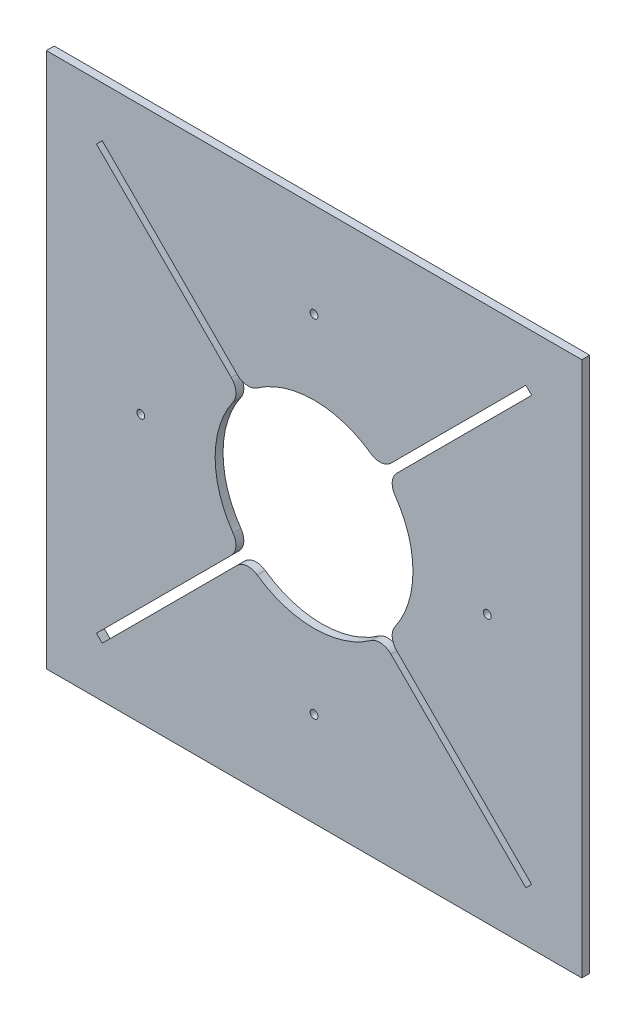
ISO-10303-21;
HEADER;
FILE_DESCRIPTION(('STEP AP214'),'2;1');
FILE_NAME('part.step','',(''),(''),'','','');
FILE_SCHEMA(('AUTOMOTIVE_DESIGN { 1 0 10303 214 1 1 1 1 }'));
ENDSEC;
DATA;
#1=APPLICATION_CONTEXT('core data for automotive mechanical design processes');
#2=APPLICATION_PROTOCOL_DEFINITION('international standard','automotive_design',2000,#1);
#3=PRODUCT_CONTEXT('',#1,'mechanical');
#4=PRODUCT('Part','Part','',(#3));
#5=PRODUCT_RELATED_PRODUCT_CATEGORY('part','',(#4));
#6=PRODUCT_DEFINITION_FORMATION('','',#4);
#7=PRODUCT_DEFINITION_CONTEXT('part definition',#1,'design');
#8=PRODUCT_DEFINITION('design','',#6,#7);
#9=PRODUCT_DEFINITION_SHAPE('','',#8);
#10=(LENGTH_UNIT() NAMED_UNIT(*) SI_UNIT(.MILLI.,.METRE.));
#11=(NAMED_UNIT(*) PLANE_ANGLE_UNIT() SI_UNIT($,.RADIAN.));
#12=(NAMED_UNIT(*) SI_UNIT($,.STERADIAN.) SOLID_ANGLE_UNIT());
#13=UNCERTAINTY_MEASURE_WITH_UNIT(LENGTH_MEASURE(1.E-05),#10,'distance_accuracy_value','');
#14=(GEOMETRIC_REPRESENTATION_CONTEXT(3) GLOBAL_UNCERTAINTY_ASSIGNED_CONTEXT((#13)) GLOBAL_UNIT_ASSIGNED_CONTEXT((#10,
#11,#12)) REPRESENTATION_CONTEXT('',''));
#15=CARTESIAN_POINT('',(0.,0.,0.));
#16=DIRECTION('',(0.,0.,1.));
#17=DIRECTION('',(1.,0.,0.));
#18=AXIS2_PLACEMENT_3D('',#15,#16,#17);
#19=CARTESIAN_POINT('',(0.,0.,0.));
#20=DIRECTION('',(0.,0.,1.));
#21=DIRECTION('',(1.,0.,0.));
#22=AXIS2_PLACEMENT_3D('',#19,#20,#21);
#23=CYLINDRICAL_SURFACE('',#22,79.756);
#24=CARTESIAN_POINT('',(0.,0.,6.35));
#25=DIRECTION('',(0.,0.,1.));
#26=DIRECTION('',(1.,0.,0.));
#27=AXIS2_PLACEMENT_3D('',#24,#25,#26);
#28=CIRCLE('',#27,79.756);
#29=CARTESIAN_POINT('',(-45.7840497373217,-65.3057449666602,6.35));
#30=VERTEX_POINT('',#29);
#31=CARTESIAN_POINT('',(45.7840497373238,-65.3057449666587,6.35));
#32=VERTEX_POINT('',#31);
#33=EDGE_CURVE('E360',#30,#32,#28,.T.);
#34=ORIENTED_EDGE('',*,*,#33,.T.);
#35=DIRECTION('',(0.,0.,1.));
#36=VECTOR('',#35,1.);
#37=CARTESIAN_POINT('',(45.7840497373238,-65.3057449666587,0.));
#38=LINE('',#37,#36);
#39=CARTESIAN_POINT('',(45.7840497373238,-65.3057449666587,0.));
#40=VERTEX_POINT('',#39);
#41=EDGE_CURVE('E469',#32,#40,#38,.F.);
#42=ORIENTED_EDGE('',*,*,#41,.T.);
#43=CARTESIAN_POINT('',(0.,0.,0.));
#44=DIRECTION('',(0.,0.,1.));
#45=DIRECTION('',(1.,0.,0.));
#46=AXIS2_PLACEMENT_3D('',#43,#44,#45);
#47=CIRCLE('',#46,79.756);
#48=CARTESIAN_POINT('',(-45.7840497373217,-65.3057449666602,0.));
#49=VERTEX_POINT('',#48);
#50=EDGE_CURVE('E358',#49,#40,#47,.T.);
#51=ORIENTED_EDGE('',*,*,#50,.F.);
#52=DIRECTION('',(0.,0.,1.));
#53=VECTOR('',#52,1.);
#54=CARTESIAN_POINT('',(-45.7840497373217,-65.3057449666602,0.));
#55=LINE('',#54,#53);
#56=EDGE_CURVE('E465',#49,#30,#55,.T.);
#57=ORIENTED_EDGE('',*,*,#56,.T.);
#58=EDGE_LOOP('',(#34,#42,#51,#57));
#59=FACE_BOUND('',#58,.T.);
#60=ADVANCED_FACE('F39',(#59),#23,.F.);
#61=CARTESIAN_POINT('',(65.3057449666625,-45.7840497373182,0.));
#62=VERTEX_POINT('',#61);
#63=CARTESIAN_POINT('',(65.305744966661,45.7840497373205,0.));
#64=VERTEX_POINT('',#63);
#65=EDGE_CURVE('E359',#62,#64,#47,.T.);
#66=ORIENTED_EDGE('',*,*,#65,.F.);
#67=DIRECTION('',(0.,0.,1.));
#68=VECTOR('',#67,1.);
#69=CARTESIAN_POINT('',(65.3057449666625,-45.7840497373182,0.));
#70=LINE('',#69,#68);
#71=CARTESIAN_POINT('',(65.3057449666625,-45.7840497373182,6.35));
#72=VERTEX_POINT('',#71);
#73=EDGE_CURVE('E412',#62,#72,#70,.T.);
#74=ORIENTED_EDGE('',*,*,#73,.T.);
#75=CARTESIAN_POINT('',(65.305744966661,45.7840497373205,6.35));
#76=VERTEX_POINT('',#75);
#77=EDGE_CURVE('E350',#72,#76,#28,.T.);
#78=ORIENTED_EDGE('',*,*,#77,.T.);
#79=DIRECTION('',(0.,0.,1.));
#80=VECTOR('',#79,1.);
#81=CARTESIAN_POINT('',(65.305744966661,45.7840497373205,0.));
#82=LINE('',#81,#80);
#83=EDGE_CURVE('E408',#76,#64,#82,.F.);
#84=ORIENTED_EDGE('',*,*,#83,.T.);
#85=EDGE_LOOP('',(#66,#74,#78,#84));
#86=FACE_BOUND('',#85,.T.);
#87=ADVANCED_FACE('F532',(#86),#23,.F.);
#88=CARTESIAN_POINT('',(45.7840497373215,65.3057449666603,0.));
#89=VERTEX_POINT('',#88);
#90=CARTESIAN_POINT('',(-45.7840497373208,65.3057449666608,0.));
#91=VERTEX_POINT('',#90);
#92=EDGE_CURVE('E357',#89,#91,#47,.T.);
#93=ORIENTED_EDGE('',*,*,#92,.F.);
#94=DIRECTION('',(0.,0.,1.));
#95=VECTOR('',#94,1.);
#96=CARTESIAN_POINT('',(45.7840497373215,65.3057449666603,0.));
#97=LINE('',#96,#95);
#98=CARTESIAN_POINT('',(45.7840497373215,65.3057449666603,6.35));
#99=VERTEX_POINT('',#98);
#100=EDGE_CURVE('E496',#89,#99,#97,.T.);
#101=ORIENTED_EDGE('',*,*,#100,.T.);
#102=CARTESIAN_POINT('',(-45.7840497373208,65.3057449666608,6.35));
#103=VERTEX_POINT('',#102);
#104=EDGE_CURVE('E365',#99,#103,#28,.T.);
#105=ORIENTED_EDGE('',*,*,#104,.T.);
#106=DIRECTION('',(0.,0.,1.));
#107=VECTOR('',#106,1.);
#108=CARTESIAN_POINT('',(-45.7840497373208,65.3057449666608,0.));
#109=LINE('',#108,#107);
#110=EDGE_CURVE('E492',#103,#91,#109,.F.);
#111=ORIENTED_EDGE('',*,*,#110,.T.);
#112=EDGE_LOOP('',(#93,#101,#105,#111));
#113=FACE_BOUND('',#112,.T.);
#114=ADVANCED_FACE('F549',(#113),#23,.F.);
#115=CARTESIAN_POINT('',(215.9,215.9,6.35));
#116=DIRECTION('',(-1.,0.,0.));
#117=DIRECTION('',(0.,-1.,0.));
#118=AXIS2_PLACEMENT_3D('',#115,#116,#117);
#119=PLANE('',#118);
#120=DIRECTION('',(0.,1.,0.));
#121=VECTOR('',#120,1.);
#122=CARTESIAN_POINT('',(215.9,215.9,0.));
#123=LINE('',#122,#121);
#124=CARTESIAN_POINT('',(215.9,-215.9,0.));
#125=VERTEX_POINT('',#124);
#126=CARTESIAN_POINT('',(215.9,215.9,0.));
#127=VERTEX_POINT('',#126);
#128=EDGE_CURVE('E381',#125,#127,#123,.T.);
#129=ORIENTED_EDGE('',*,*,#128,.T.);
#130=DIRECTION('',(0.,0.,-1.));
#131=VECTOR('',#130,1.);
#132=CARTESIAN_POINT('',(215.9,215.9,6.35));
#133=LINE('',#132,#131);
#134=CARTESIAN_POINT('',(215.9,215.9,6.35));
#135=VERTEX_POINT('',#134);
#136=EDGE_CURVE('E404',#135,#127,#133,.T.);
#137=ORIENTED_EDGE('',*,*,#136,.F.);
#138=DIRECTION('',(0.,1.,0.));
#139=VECTOR('',#138,1.);
#140=CARTESIAN_POINT('',(215.9,215.9,6.35));
#141=LINE('',#140,#139);
#142=CARTESIAN_POINT('',(215.9,-215.9,6.35));
#143=VERTEX_POINT('',#142);
#144=EDGE_CURVE('E366',#143,#135,#141,.T.);
#145=ORIENTED_EDGE('',*,*,#144,.F.);
#146=DIRECTION('',(0.,0.,-1.));
#147=VECTOR('',#146,1.);
#148=CARTESIAN_POINT('',(215.9,-215.9,6.35));
#149=LINE('',#148,#147);
#150=EDGE_CURVE('E380',#143,#125,#149,.T.);
#151=ORIENTED_EDGE('',*,*,#150,.T.);
#152=EDGE_LOOP('',(#129,#137,#145,#151));
#153=FACE_BOUND('',#152,.T.);
#154=ADVANCED_FACE('F619',(#153),#119,.F.);
#155=CARTESIAN_POINT('',(-215.9,215.9,6.35));
#156=DIRECTION('',(0.,-1.,0.));
#157=DIRECTION('',(0.,0.,-1.));
#158=AXIS2_PLACEMENT_3D('',#155,#156,#157);
#159=PLANE('',#158);
#160=DIRECTION('',(-1.,0.,0.));
#161=VECTOR('',#160,1.);
#162=CARTESIAN_POINT('',(-215.9,215.9,0.));
#163=LINE('',#162,#161);
#164=CARTESIAN_POINT('',(-215.9,215.9,0.));
#165=VERTEX_POINT('',#164);
#166=EDGE_CURVE('E385',#127,#165,#163,.T.);
#167=ORIENTED_EDGE('',*,*,#166,.T.);
#168=DIRECTION('',(0.,0.,-1.));
#169=VECTOR('',#168,1.);
#170=CARTESIAN_POINT('',(-215.9,215.9,6.35));
#171=LINE('',#170,#169);
#172=CARTESIAN_POINT('',(-215.9,215.9,6.35));
#173=VERTEX_POINT('',#172);
#174=EDGE_CURVE('E400',#173,#165,#171,.T.);
#175=ORIENTED_EDGE('',*,*,#174,.F.);
#176=DIRECTION('',(-1.,0.,0.));
#177=VECTOR('',#176,1.);
#178=CARTESIAN_POINT('',(-215.9,215.9,6.35));
#179=LINE('',#178,#177);
#180=EDGE_CURVE('E370',#135,#173,#179,.T.);
#181=ORIENTED_EDGE('',*,*,#180,.F.);
#182=ORIENTED_EDGE('',*,*,#136,.T.);
#183=EDGE_LOOP('',(#167,#175,#181,#182));
#184=FACE_BOUND('',#183,.T.);
#185=ADVANCED_FACE('F623',(#184),#159,.F.);
#186=CARTESIAN_POINT('',(-215.9,215.9,6.35));
#187=DIRECTION('',(1.,0.,0.));
#188=DIRECTION('',(0.,1.,0.));
#189=AXIS2_PLACEMENT_3D('',#186,#187,#188);
#190=PLANE('',#189);
#191=DIRECTION('',(0.,-1.,0.));
#192=VECTOR('',#191,1.);
#193=CARTESIAN_POINT('',(-215.9,215.9,0.));
#194=LINE('',#193,#192);
#195=CARTESIAN_POINT('',(-215.9,-215.9,0.));
#196=VERTEX_POINT('',#195);
#197=EDGE_CURVE('E388',#165,#196,#194,.T.);
#198=ORIENTED_EDGE('',*,*,#197,.T.);
#199=DIRECTION('',(0.,0.,-1.));
#200=VECTOR('',#199,1.);
#201=CARTESIAN_POINT('',(-215.9,-215.9,6.35));
#202=LINE('',#201,#200);
#203=CARTESIAN_POINT('',(-215.9,-215.9,6.35));
#204=VERTEX_POINT('',#203);
#205=EDGE_CURVE('E396',#204,#196,#202,.T.);
#206=ORIENTED_EDGE('',*,*,#205,.F.);
#207=DIRECTION('',(0.,-1.,0.));
#208=VECTOR('',#207,1.);
#209=CARTESIAN_POINT('',(-215.9,215.9,6.35));
#210=LINE('',#209,#208);
#211=EDGE_CURVE('E374',#173,#204,#210,.T.);
#212=ORIENTED_EDGE('',*,*,#211,.F.);
#213=ORIENTED_EDGE('',*,*,#174,.T.);
#214=EDGE_LOOP('',(#198,#206,#212,#213));
#215=FACE_BOUND('',#214,.T.);
#216=ADVANCED_FACE('F629',(#215),#190,.F.);
#217=CARTESIAN_POINT('',(-215.9,-215.9,6.35));
#218=DIRECTION('',(0.,1.,0.));
#219=DIRECTION('',(0.,0.,1.));
#220=AXIS2_PLACEMENT_3D('',#217,#218,#219);
#221=PLANE('',#220);
#222=DIRECTION('',(1.,0.,0.));
#223=VECTOR('',#222,1.);
#224=CARTESIAN_POINT('',(-215.9,-215.9,0.));
#225=LINE('',#224,#223);
#226=EDGE_CURVE('E371',#196,#125,#225,.T.);
#227=ORIENTED_EDGE('',*,*,#226,.T.);
#228=ORIENTED_EDGE('',*,*,#150,.F.);
#229=DIRECTION('',(1.,0.,0.));
#230=VECTOR('',#229,1.);
#231=CARTESIAN_POINT('',(-215.9,-215.9,6.35));
#232=LINE('',#231,#230);
#233=EDGE_CURVE('E377',#204,#143,#232,.T.);
#234=ORIENTED_EDGE('',*,*,#233,.F.);
#235=ORIENTED_EDGE('',*,*,#205,.T.);
#236=EDGE_LOOP('',(#227,#228,#234,#235));
#237=FACE_BOUND('',#236,.T.);
#238=ADVANCED_FACE('F742',(#237),#221,.F.);
#239=CARTESIAN_POINT('',(0.,0.,6.35));
#240=DIRECTION('',(0.,0.,1.));
#241=DIRECTION('',(1.,0.,0.));
#242=AXIS2_PLACEMENT_3D('',#239,#240,#241);
#243=PLANE('',#242);
#244=CARTESIAN_POINT('',(0.,139.7,6.35));
#245=DIRECTION('',(0.,0.,1.));
#246=DIRECTION('',(1.,0.,0.));
#247=AXIS2_PLACEMENT_3D('',#244,#245,#246);
#248=CIRCLE('',#247,3.175);
#249=CARTESIAN_POINT('',(3.175,139.7,6.35));
#250=VERTEX_POINT('',#249);
#251=EDGE_CURVE('E777',#250,#250,#248,.T.);
#252=ORIENTED_EDGE('',*,*,#251,.F.);
#253=EDGE_LOOP('',(#252));
#254=FACE_BOUND('',#253,.T.);
#255=CARTESIAN_POINT('',(139.700000000004,3.9448503337513E-12,6.35));
#256=DIRECTION('',(0.,0.,1.));
#257=DIRECTION('',(1.,0.,0.));
#258=AXIS2_PLACEMENT_3D('',#255,#256,#257);
#259=CIRCLE('',#258,3.17500000000307);
#260=CARTESIAN_POINT('',(142.875000000007,3.9448503337513E-12,6.35));
#261=VERTEX_POINT('',#260);
#262=EDGE_CURVE('E781',#261,#261,#259,.T.);
#263=ORIENTED_EDGE('',*,*,#262,.F.);
#264=EDGE_LOOP('',(#263));
#265=FACE_BOUND('',#264,.T.);
#266=CARTESIAN_POINT('',(7.88970066750261E-12,-139.7,6.35));
#267=DIRECTION('',(0.,0.,1.));
#268=DIRECTION('',(1.,0.,0.));
#269=AXIS2_PLACEMENT_3D('',#266,#267,#268);
#270=CIRCLE('',#269,3.17500000000847);
#271=CARTESIAN_POINT('',(3.17500000001636,-139.7,6.35));
#272=VERTEX_POINT('',#271);
#273=EDGE_CURVE('E785',#272,#272,#270,.T.);
#274=ORIENTED_EDGE('',*,*,#273,.F.);
#275=EDGE_LOOP('',(#274));
#276=FACE_BOUND('',#275,.T.);
#277=CARTESIAN_POINT('',(-139.699999999996,-3.96195864953539E-12,6.35));
#278=DIRECTION('',(0.,0.,1.));
#279=DIRECTION('',(1.,0.,0.));
#280=AXIS2_PLACEMENT_3D('',#277,#278,#279);
#281=CIRCLE('',#280,3.17500000000634);
#282=CARTESIAN_POINT('',(-136.52499999999,-3.96195864953539E-12,6.35));
#283=VERTEX_POINT('',#282);
#284=EDGE_CURVE('E788',#283,#283,#281,.T.);
#285=ORIENTED_EDGE('',*,*,#284,.F.);
#286=EDGE_LOOP('',(#285));
#287=FACE_BOUND('',#286,.T.);
#288=ORIENTED_EDGE('',*,*,#77,.F.);
#289=CARTESIAN_POINT('',(75.7047489422458,-53.074503517146,6.35));
#290=DIRECTION('',(0.,0.,1.));
#291=DIRECTION('',(1.,0.,0.));
#292=AXIS2_PLACEMENT_3D('',#289,#290,#291);
#293=CIRCLE('',#292,12.7);
#294=CARTESIAN_POINT('',(66.7244928211764,-62.0547596382149,6.35));
#295=VERTEX_POINT('',#294);
#296=EDGE_CURVE('E437',#72,#295,#293,.T.);
#297=ORIENTED_EDGE('',*,*,#296,.T.);
#298=DIRECTION('',(-0.707106781186528,0.707106781186566,0.));
#299=VECTOR('',#298,1.);
#300=CARTESIAN_POINT('',(55.5321847392618,-50.8624515562998,6.35));
#301=LINE('',#300,#299);
#302=CARTESIAN_POINT('',(175.474204605691,-170.804471422736,6.35));
#303=VERTEX_POINT('',#302);
#304=EDGE_CURVE('E280',#303,#295,#301,.T.);
#305=ORIENTED_EDGE('',*,*,#304,.F.);
#306=DIRECTION('',(0.70710678118655,0.707106781186545,0.));
#307=VECTOR('',#306,1.);
#308=CARTESIAN_POINT('',(170.804471422735,-175.474204605692,6.35));
#309=LINE('',#308,#307);
#310=CARTESIAN_POINT('',(170.804471422735,-175.474204605692,6.35));
#311=VERTEX_POINT('',#310);
#312=EDGE_CURVE('E272',#311,#303,#309,.T.);
#313=ORIENTED_EDGE('',*,*,#312,.F.);
#314=DIRECTION('',(0.707106781186529,-0.707106781186566,0.));
#315=VECTOR('',#314,1.);
#316=CARTESIAN_POINT('',(170.804471422735,-175.474204605692,6.35));
#317=LINE('',#316,#315);
#318=CARTESIAN_POINT('',(62.0547596382219,-66.7244928211724,6.35));
#319=VERTEX_POINT('',#318);
#320=EDGE_CURVE('E284',#319,#311,#317,.T.);
#321=ORIENTED_EDGE('',*,*,#320,.F.);
#322=CARTESIAN_POINT('',(53.0745035171524,-75.7047489422412,6.35));
#323=DIRECTION('',(0.,0.,1.));
#324=DIRECTION('',(1.,0.,0.));
#325=AXIS2_PLACEMENT_3D('',#322,#323,#324);
#326=CIRCLE('',#325,12.7);
#327=EDGE_CURVE('E434',#319,#32,#326,.T.);
#328=ORIENTED_EDGE('',*,*,#327,.T.);
#329=ORIENTED_EDGE('',*,*,#33,.F.);
#330=CARTESIAN_POINT('',(-53.0745035171499,-75.704748942243,6.35));
#331=DIRECTION('',(0.,0.,1.));
#332=DIRECTION('',(1.,0.,0.));
#333=AXIS2_PLACEMENT_3D('',#330,#331,#332);
#334=CIRCLE('',#333,12.7);
#335=CARTESIAN_POINT('',(-62.0547596382193,-66.724492821174,6.35));
#336=VERTEX_POINT('',#335);
#337=EDGE_CURVE('E431',#30,#336,#334,.T.);
#338=ORIENTED_EDGE('',*,*,#337,.T.);
#339=DIRECTION('',(0.707106781186534,0.707106781186561,0.));
#340=VECTOR('',#339,1.);
#341=CARTESIAN_POINT('',(-50.8624515563038,-55.5321847392581,6.35));
#342=LINE('',#341,#340);
#343=CARTESIAN_POINT('',(-170.804471422732,-175.474204605691,6.35));
#344=VERTEX_POINT('',#343);
#345=EDGE_CURVE('E309',#344,#336,#342,.T.);
#346=ORIENTED_EDGE('',*,*,#345,.F.);
#347=DIRECTION('',(0.707106781186547,-0.707106781186547,0.));
#348=VECTOR('',#347,1.);
#349=CARTESIAN_POINT('',(-175.474204605688,-170.804471422735,6.35));
#350=LINE('',#349,#348);
#351=CARTESIAN_POINT('',(-175.474204605688,-170.804471422735,6.35));
#352=VERTEX_POINT('',#351);
#353=EDGE_CURVE('E301',#352,#344,#350,.T.);
#354=ORIENTED_EDGE('',*,*,#353,.F.);
#355=DIRECTION('',(-0.707106781186534,-0.707106781186561,0.));
#356=VECTOR('',#355,1.);
#357=CARTESIAN_POINT('',(-175.474204605688,-170.804471422735,6.35));
#358=LINE('',#357,#356);
#359=CARTESIAN_POINT('',(-66.7244928211747,-62.0547596382175,6.35));
#360=VERTEX_POINT('',#359);
#361=EDGE_CURVE('E313',#360,#352,#358,.T.);
#362=ORIENTED_EDGE('',*,*,#361,.F.);
#363=CARTESIAN_POINT('',(-75.704748942244,-53.0745035171485,6.35));
#364=DIRECTION('',(0.,0.,1.));
#365=DIRECTION('',(1.,0.,0.));
#366=AXIS2_PLACEMENT_3D('',#363,#364,#365);
#367=CIRCLE('',#366,12.7);
#368=CARTESIAN_POINT('',(-65.305744966661,-45.7840497373204,6.35));
#369=VERTEX_POINT('',#368);
#370=EDGE_CURVE('E428',#360,#369,#367,.T.);
#371=ORIENTED_EDGE('',*,*,#370,.T.);
#372=CARTESIAN_POINT('',(-65.3057449666604,45.7840497373213,6.35));
#373=VERTEX_POINT('',#372);
#374=EDGE_CURVE('E364',#373,#369,#28,.T.);
#375=ORIENTED_EDGE('',*,*,#374,.F.);
#376=CARTESIAN_POINT('',(-75.7047489422433,53.0745035171495,6.35));
#377=DIRECTION('',(0.,0.,1.));
#378=DIRECTION('',(1.,0.,0.));
#379=AXIS2_PLACEMENT_3D('',#376,#377,#378);
#380=CIRCLE('',#379,12.7);
#381=CARTESIAN_POINT('',(-66.7244928211741,62.0547596382187,6.35));
#382=VERTEX_POINT('',#381);
#383=EDGE_CURVE('E419',#373,#382,#380,.T.);
#384=ORIENTED_EDGE('',*,*,#383,.T.);
#385=DIRECTION('',(0.707106781186549,-0.707106781186546,0.));
#386=VECTOR('',#385,1.);
#387=CARTESIAN_POINT('',(-55.5321847392586,50.8624515563032,6.35));
#388=LINE('',#387,#386);
#389=CARTESIAN_POINT('',(-175.474204605691,170.804471422735,6.35));
#390=VERTEX_POINT('',#389);
#391=EDGE_CURVE('E266',#390,#382,#388,.T.);
#392=ORIENTED_EDGE('',*,*,#391,.F.);
#393=DIRECTION('',(-0.70710678118655,-0.707106781186545,0.));
#394=VECTOR('',#393,1.);
#395=CARTESIAN_POINT('',(-170.804471422735,175.474204605691,6.35));
#396=LINE('',#395,#394);
#397=CARTESIAN_POINT('',(-170.804471422735,175.474204605691,6.35));
#398=VERTEX_POINT('',#397);
#399=EDGE_CURVE('E330',#398,#390,#396,.T.);
#400=ORIENTED_EDGE('',*,*,#399,.F.);
#401=DIRECTION('',(-0.707106781186549,0.707106781186546,0.));
#402=VECTOR('',#401,1.);
#403=CARTESIAN_POINT('',(-170.804471422735,175.474204605691,6.35));
#404=LINE('',#403,#402);
#405=CARTESIAN_POINT('',(-62.054759638218,66.7244928211745,6.35));
#406=VERTEX_POINT('',#405);
#407=EDGE_CURVE('E341',#406,#398,#404,.T.);
#408=ORIENTED_EDGE('',*,*,#407,.F.);
#409=CARTESIAN_POINT('',(-53.0745035171489,75.7047489422437,6.35));
#410=DIRECTION('',(0.,0.,1.));
#411=DIRECTION('',(1.,0.,0.));
#412=AXIS2_PLACEMENT_3D('',#409,#410,#411);
#413=CIRCLE('',#412,12.7);
#414=EDGE_CURVE('E416',#406,#103,#413,.T.);
#415=ORIENTED_EDGE('',*,*,#414,.T.);
#416=ORIENTED_EDGE('',*,*,#104,.F.);
#417=CARTESIAN_POINT('',(53.0745035171498,75.7047489422431,6.35));
#418=DIRECTION('',(0.,0.,1.));
#419=DIRECTION('',(1.,0.,0.));
#420=AXIS2_PLACEMENT_3D('',#417,#418,#419);
#421=CIRCLE('',#420,12.7);
#422=CARTESIAN_POINT('',(62.0547596382189,66.7244928211739,6.35));
#423=VERTEX_POINT('',#422);
#424=EDGE_CURVE('E422',#99,#423,#421,.T.);
#425=ORIENTED_EDGE('',*,*,#424,.T.);
#426=DIRECTION('',(-0.707106781186548,-0.707106781186547,0.));
#427=VECTOR('',#426,1.);
#428=CARTESIAN_POINT('',(50.8624515563034,55.5321847392584,6.35));
#429=LINE('',#428,#427);
#430=CARTESIAN_POINT('',(170.804471422736,175.474204605691,6.35));
#431=VERTEX_POINT('',#430);
#432=EDGE_CURVE('E255',#431,#423,#429,.T.);
#433=ORIENTED_EDGE('',*,*,#432,.F.);
#434=DIRECTION('',(-0.707106781186541,0.707106781186554,0.));
#435=VECTOR('',#434,1.);
#436=CARTESIAN_POINT('',(175.474204605692,170.804471422735,6.35));
#437=LINE('',#436,#435);
#438=CARTESIAN_POINT('',(175.474204605692,170.804471422735,6.35));
#439=VERTEX_POINT('',#438);
#440=EDGE_CURVE('E262',#439,#431,#437,.T.);
#441=ORIENTED_EDGE('',*,*,#440,.F.);
#442=DIRECTION('',(0.707106781186548,0.707106781186547,0.));
#443=VECTOR('',#442,1.);
#444=CARTESIAN_POINT('',(175.474204605692,170.804471422735,6.35));
#445=LINE('',#444,#443);
#446=CARTESIAN_POINT('',(66.7244928211747,62.0547596382178,6.35));
#447=VERTEX_POINT('',#446);
#448=EDGE_CURVE('E242',#447,#439,#445,.T.);
#449=ORIENTED_EDGE('',*,*,#448,.F.);
#450=CARTESIAN_POINT('',(75.7047489422439,53.0745035171486,6.35));
#451=DIRECTION('',(0.,0.,1.));
#452=DIRECTION('',(1.,0.,0.));
#453=AXIS2_PLACEMENT_3D('',#450,#451,#452);
#454=CIRCLE('',#453,12.7);
#455=EDGE_CURVE('E425',#447,#76,#454,.T.);
#456=ORIENTED_EDGE('',*,*,#455,.T.);
#457=EDGE_LOOP('',(#288,#297,#305,#313,#321,#328,#329,#338,#346,#354,#362,#371,#375,#384,#392,
#400,#408,#415,#416,#425,#433,#441,#449,#456));
#458=FACE_BOUND('',#457,.T.);
#459=ORIENTED_EDGE('',*,*,#144,.T.);
#460=ORIENTED_EDGE('',*,*,#180,.T.);
#461=ORIENTED_EDGE('',*,*,#211,.T.);
#462=ORIENTED_EDGE('',*,*,#233,.T.);
#463=EDGE_LOOP('',(#459,#460,#461,#462));
#464=FACE_BOUND('',#463,.T.);
#465=ADVANCED_FACE('F520',(#254,#265,#276,#287,#458,#464),#243,.T.);
#466=CARTESIAN_POINT('',(0.,0.,0.));
#467=DIRECTION('',(0.,0.,1.));
#468=DIRECTION('',(1.,0.,0.));
#469=AXIS2_PLACEMENT_3D('',#466,#467,#468);
#470=PLANE('',#469);
#471=CARTESIAN_POINT('',(0.,139.7,0.));
#472=DIRECTION('',(0.,0.,1.));
#473=DIRECTION('',(1.,0.,0.));
#474=AXIS2_PLACEMENT_3D('',#471,#472,#473);
#475=CIRCLE('',#474,3.175);
#476=CARTESIAN_POINT('',(3.175,139.7,0.));
#477=VERTEX_POINT('',#476);
#478=EDGE_CURVE('E314',#477,#477,#475,.T.);
#479=ORIENTED_EDGE('',*,*,#478,.T.);
#480=EDGE_LOOP('',(#479));
#481=FACE_BOUND('',#480,.T.);
#482=CARTESIAN_POINT('',(139.700000000004,3.9448503337513E-12,0.));
#483=DIRECTION('',(0.,0.,1.));
#484=DIRECTION('',(1.,0.,0.));
#485=AXIS2_PLACEMENT_3D('',#482,#483,#484);
#486=CIRCLE('',#485,3.17500000000307);
#487=CARTESIAN_POINT('',(142.875000000007,3.9448503337513E-12,0.));
#488=VERTEX_POINT('',#487);
#489=EDGE_CURVE('E803',#488,#488,#486,.T.);
#490=ORIENTED_EDGE('',*,*,#489,.T.);
#491=EDGE_LOOP('',(#490));
#492=FACE_BOUND('',#491,.T.);
#493=CARTESIAN_POINT('',(7.88970066750261E-12,-139.7,0.));
#494=DIRECTION('',(0.,0.,1.));
#495=DIRECTION('',(1.,0.,0.));
#496=AXIS2_PLACEMENT_3D('',#493,#494,#495);
#497=CIRCLE('',#496,3.17500000000847);
#498=CARTESIAN_POINT('',(3.17500000001636,-139.7,0.));
#499=VERTEX_POINT('',#498);
#500=EDGE_CURVE('E809',#499,#499,#497,.T.);
#501=ORIENTED_EDGE('',*,*,#500,.T.);
#502=EDGE_LOOP('',(#501));
#503=FACE_BOUND('',#502,.T.);
#504=CARTESIAN_POINT('',(-139.699999999996,-3.96195864953539E-12,0.));
#505=DIRECTION('',(0.,0.,1.));
#506=DIRECTION('',(1.,0.,0.));
#507=AXIS2_PLACEMENT_3D('',#504,#505,#506);
#508=CIRCLE('',#507,3.17500000000634);
#509=CARTESIAN_POINT('',(-136.52499999999,-3.96195864953539E-12,0.));
#510=VERTEX_POINT('',#509);
#511=EDGE_CURVE('E791',#510,#510,#508,.T.);
#512=ORIENTED_EDGE('',*,*,#511,.T.);
#513=EDGE_LOOP('',(#512));
#514=FACE_BOUND('',#513,.T.);
#515=DIRECTION('',(-0.707106781186528,0.707106781186566,0.));
#516=VECTOR('',#515,1.);
#517=CARTESIAN_POINT('',(55.5321847392618,-50.8624515562998,0.));
#518=LINE('',#517,#516);
#519=CARTESIAN_POINT('',(175.474204605691,-170.804471422736,0.));
#520=VERTEX_POINT('',#519);
#521=CARTESIAN_POINT('',(66.7244928211764,-62.0547596382149,0.));
#522=VERTEX_POINT('',#521);
#523=EDGE_CURVE('E268',#520,#522,#518,.T.);
#524=ORIENTED_EDGE('',*,*,#523,.T.);
#525=CARTESIAN_POINT('',(75.7047489422458,-53.074503517146,0.));
#526=DIRECTION('',(0.,0.,1.));
#527=DIRECTION('',(1.,0.,0.));
#528=AXIS2_PLACEMENT_3D('',#525,#526,#527);
#529=CIRCLE('',#528,12.7);
#530=EDGE_CURVE('E462',#522,#62,#529,.F.);
#531=ORIENTED_EDGE('',*,*,#530,.T.);
#532=ORIENTED_EDGE('',*,*,#65,.T.);
#533=CARTESIAN_POINT('',(75.7047489422439,53.0745035171486,0.));
#534=DIRECTION('',(0.,0.,1.));
#535=DIRECTION('',(1.,0.,0.));
#536=AXIS2_PLACEMENT_3D('',#533,#534,#535);
#537=CIRCLE('',#536,12.7);
#538=CARTESIAN_POINT('',(66.7244928211747,62.0547596382178,0.));
#539=VERTEX_POINT('',#538);
#540=EDGE_CURVE('E232',#64,#539,#537,.F.);
#541=ORIENTED_EDGE('',*,*,#540,.T.);
#542=DIRECTION('',(0.707106781186548,0.707106781186547,0.));
#543=VECTOR('',#542,1.);
#544=CARTESIAN_POINT('',(175.474204605692,170.804471422735,0.));
#545=LINE('',#544,#543);
#546=CARTESIAN_POINT('',(175.474204605692,170.804471422735,0.));
#547=VERTEX_POINT('',#546);
#548=EDGE_CURVE('E223',#539,#547,#545,.T.);
#549=ORIENTED_EDGE('',*,*,#548,.T.);
#550=DIRECTION('',(-0.707106781186541,0.707106781186554,0.));
#551=VECTOR('',#550,1.);
#552=CARTESIAN_POINT('',(175.474204605692,170.804471422735,0.));
#553=LINE('',#552,#551);
#554=CARTESIAN_POINT('',(170.804471422736,175.474204605691,0.));
#555=VERTEX_POINT('',#554);
#556=EDGE_CURVE('E230',#547,#555,#553,.T.);
#557=ORIENTED_EDGE('',*,*,#556,.T.);
#558=DIRECTION('',(-0.707106781186548,-0.707106781186547,0.));
#559=VECTOR('',#558,1.);
#560=CARTESIAN_POINT('',(50.8624515563034,55.5321847392584,0.));
#561=LINE('',#560,#559);
#562=CARTESIAN_POINT('',(62.0547596382189,66.7244928211739,0.));
#563=VERTEX_POINT('',#562);
#564=EDGE_CURVE('E236',#555,#563,#561,.T.);
#565=ORIENTED_EDGE('',*,*,#564,.T.);
#566=CARTESIAN_POINT('',(53.0745035171498,75.7047489422431,0.));
#567=DIRECTION('',(0.,0.,1.));
#568=DIRECTION('',(1.,0.,0.));
#569=AXIS2_PLACEMENT_3D('',#566,#567,#568);
#570=CIRCLE('',#569,12.7);
#571=EDGE_CURVE('E449',#563,#89,#570,.F.);
#572=ORIENTED_EDGE('',*,*,#571,.T.);
#573=ORIENTED_EDGE('',*,*,#92,.T.);
#574=CARTESIAN_POINT('',(-53.0745035171489,75.7047489422437,0.));
#575=DIRECTION('',(0.,0.,1.));
#576=DIRECTION('',(1.,0.,0.));
#577=AXIS2_PLACEMENT_3D('',#574,#575,#576);
#578=CIRCLE('',#577,12.7);
#579=CARTESIAN_POINT('',(-62.054759638218,66.7244928211745,0.));
#580=VERTEX_POINT('',#579);
#581=EDGE_CURVE('E443',#91,#580,#578,.F.);
#582=ORIENTED_EDGE('',*,*,#581,.T.);
#583=DIRECTION('',(-0.707106781186549,0.707106781186546,0.));
#584=VECTOR('',#583,1.);
#585=CARTESIAN_POINT('',(-170.804471422735,175.474204605691,0.));
#586=LINE('',#585,#584);
#587=CARTESIAN_POINT('',(-170.804471422735,175.474204605691,0.));
#588=VERTEX_POINT('',#587);
#589=EDGE_CURVE('E329',#580,#588,#586,.T.);
#590=ORIENTED_EDGE('',*,*,#589,.T.);
#591=DIRECTION('',(-0.70710678118655,-0.707106781186545,0.));
#592=VECTOR('',#591,1.);
#593=CARTESIAN_POINT('',(-170.804471422735,175.474204605691,0.));
#594=LINE('',#593,#592);
#595=CARTESIAN_POINT('',(-175.474204605691,170.804471422735,0.));
#596=VERTEX_POINT('',#595);
#597=EDGE_CURVE('E333',#588,#596,#594,.T.);
#598=ORIENTED_EDGE('',*,*,#597,.T.);
#599=DIRECTION('',(0.707106781186549,-0.707106781186546,0.));
#600=VECTOR('',#599,1.);
#601=CARTESIAN_POINT('',(-55.5321847392586,50.8624515563032,0.));
#602=LINE('',#601,#600);
#603=CARTESIAN_POINT('',(-66.7244928211741,62.0547596382187,0.));
#604=VERTEX_POINT('',#603);
#605=EDGE_CURVE('E325',#596,#604,#602,.T.);
#606=ORIENTED_EDGE('',*,*,#605,.T.);
#607=CARTESIAN_POINT('',(-75.7047489422433,53.0745035171495,0.));
#608=DIRECTION('',(0.,0.,1.));
#609=DIRECTION('',(1.,0.,0.));
#610=AXIS2_PLACEMENT_3D('',#607,#608,#609);
#611=CIRCLE('',#610,12.7);
#612=CARTESIAN_POINT('',(-65.3057449666604,45.7840497373213,0.));
#613=VERTEX_POINT('',#612);
#614=EDGE_CURVE('E446',#604,#613,#611,.F.);
#615=ORIENTED_EDGE('',*,*,#614,.T.);
#616=CARTESIAN_POINT('',(-65.305744966661,-45.7840497373204,0.));
#617=VERTEX_POINT('',#616);
#618=EDGE_CURVE('E354',#613,#617,#47,.T.);
#619=ORIENTED_EDGE('',*,*,#618,.T.);
#620=CARTESIAN_POINT('',(-75.704748942244,-53.0745035171485,0.));
#621=DIRECTION('',(0.,0.,1.));
#622=DIRECTION('',(1.,0.,0.));
#623=AXIS2_PLACEMENT_3D('',#620,#621,#622);
#624=CIRCLE('',#623,12.7);
#625=CARTESIAN_POINT('',(-66.7244928211747,-62.0547596382175,0.));
#626=VERTEX_POINT('',#625);
#627=EDGE_CURVE('E55',#617,#626,#624,.F.);
#628=ORIENTED_EDGE('',*,*,#627,.T.);
#629=DIRECTION('',(-0.707106781186534,-0.707106781186561,0.));
#630=VECTOR('',#629,1.);
#631=CARTESIAN_POINT('',(-175.474204605688,-170.804471422735,0.));
#632=LINE('',#631,#630);
#633=CARTESIAN_POINT('',(-175.474204605688,-170.804471422735,0.));
#634=VERTEX_POINT('',#633);
#635=EDGE_CURVE('E300',#626,#634,#632,.T.);
#636=ORIENTED_EDGE('',*,*,#635,.T.);
#637=DIRECTION('',(0.707106781186547,-0.707106781186547,0.));
#638=VECTOR('',#637,1.);
#639=CARTESIAN_POINT('',(-175.474204605688,-170.804471422735,0.));
#640=LINE('',#639,#638);
#641=CARTESIAN_POINT('',(-170.804471422732,-175.474204605691,0.));
#642=VERTEX_POINT('',#641);
#643=EDGE_CURVE('E304',#634,#642,#640,.T.);
#644=ORIENTED_EDGE('',*,*,#643,.T.);
#645=DIRECTION('',(0.707106781186534,0.707106781186561,0.));
#646=VECTOR('',#645,1.);
#647=CARTESIAN_POINT('',(-50.8624515563038,-55.5321847392581,0.));
#648=LINE('',#647,#646);
#649=CARTESIAN_POINT('',(-62.0547596382193,-66.724492821174,0.));
#650=VERTEX_POINT('',#649);
#651=EDGE_CURVE('E296',#642,#650,#648,.T.);
#652=ORIENTED_EDGE('',*,*,#651,.T.);
#653=CARTESIAN_POINT('',(-53.0745035171499,-75.704748942243,0.));
#654=DIRECTION('',(0.,0.,1.));
#655=DIRECTION('',(1.,0.,0.));
#656=AXIS2_PLACEMENT_3D('',#653,#654,#655);
#657=CIRCLE('',#656,12.7);
#658=EDGE_CURVE('E456',#650,#49,#657,.F.);
#659=ORIENTED_EDGE('',*,*,#658,.T.);
#660=ORIENTED_EDGE('',*,*,#50,.T.);
#661=CARTESIAN_POINT('',(53.0745035171524,-75.7047489422412,0.));
#662=DIRECTION('',(0.,0.,1.));
#663=DIRECTION('',(1.,0.,0.));
#664=AXIS2_PLACEMENT_3D('',#661,#662,#663);
#665=CIRCLE('',#664,12.7);
#666=CARTESIAN_POINT('',(62.0547596382219,-66.7244928211724,0.));
#667=VERTEX_POINT('',#666);
#668=EDGE_CURVE('E459',#40,#667,#665,.F.);
#669=ORIENTED_EDGE('',*,*,#668,.T.);
#670=DIRECTION('',(0.707106781186529,-0.707106781186566,0.));
#671=VECTOR('',#670,1.);
#672=CARTESIAN_POINT('',(170.804471422735,-175.474204605692,0.));
#673=LINE('',#672,#671);
#674=CARTESIAN_POINT('',(170.804471422735,-175.474204605692,0.));
#675=VERTEX_POINT('',#674);
#676=EDGE_CURVE('E271',#667,#675,#673,.T.);
#677=ORIENTED_EDGE('',*,*,#676,.T.);
#678=DIRECTION('',(0.70710678118655,0.707106781186545,0.));
#679=VECTOR('',#678,1.);
#680=CARTESIAN_POINT('',(170.804471422735,-175.474204605692,0.));
#681=LINE('',#680,#679);
#682=EDGE_CURVE('E275',#675,#520,#681,.T.);
#683=ORIENTED_EDGE('',*,*,#682,.T.);
#684=EDGE_LOOP('',(#524,#531,#532,#541,#549,#557,#565,#572,#573,#582,#590,#598,#606,#615,#619,
#628,#636,#644,#652,#659,#660,#669,#677,#683));
#685=FACE_BOUND('',#684,.T.);
#686=ORIENTED_EDGE('',*,*,#128,.F.);
#687=ORIENTED_EDGE('',*,*,#226,.F.);
#688=ORIENTED_EDGE('',*,*,#197,.F.);
#689=ORIENTED_EDGE('',*,*,#166,.F.);
#690=EDGE_LOOP('',(#686,#687,#688,#689));
#691=FACE_BOUND('',#690,.T.);
#692=ADVANCED_FACE('F226',(#481,#492,#503,#514,#685,#691),#470,.F.);
#693=ORIENTED_EDGE('',*,*,#374,.T.);
#694=DIRECTION('',(0.,0.,1.));
#695=VECTOR('',#694,1.);
#696=CARTESIAN_POINT('',(-65.3057449666611,-45.7840497373204,0.));
#697=LINE('',#696,#695);
#698=EDGE_CURVE('E483',#369,#617,#697,.F.);
#699=ORIENTED_EDGE('',*,*,#698,.T.);
#700=ORIENTED_EDGE('',*,*,#618,.F.);
#701=DIRECTION('',(0.,0.,1.));
#702=VECTOR('',#701,1.);
#703=CARTESIAN_POINT('',(-65.3057449666604,45.7840497373213,0.));
#704=LINE('',#703,#702);
#705=EDGE_CURVE('E479',#613,#373,#704,.T.);
#706=ORIENTED_EDGE('',*,*,#705,.T.);
#707=EDGE_LOOP('',(#693,#699,#700,#706));
#708=FACE_BOUND('',#707,.T.);
#709=ADVANCED_FACE('F517',(#708),#23,.F.);
#710=CARTESIAN_POINT('',(-55.5321847392586,50.8624515563032,0.));
#711=DIRECTION('',(-0.707106781186546,-0.707106781186549,0.));
#712=DIRECTION('',(0.707106781186549,-0.707106781186546,0.));
#713=AXIS2_PLACEMENT_3D('',#710,#711,#712);
#714=PLANE('',#713);
#715=ORIENTED_EDGE('',*,*,#391,.T.);
#716=DIRECTION('',(0.,0.,1.));
#717=VECTOR('',#716,1.);
#718=CARTESIAN_POINT('',(-66.7244928211741,62.0547596382187,0.));
#719=LINE('',#718,#717);
#720=EDGE_CURVE('E48',#382,#604,#719,.F.);
#721=ORIENTED_EDGE('',*,*,#720,.T.);
#722=ORIENTED_EDGE('',*,*,#605,.F.);
#723=DIRECTION('',(0.,0.,1.));
#724=VECTOR('',#723,1.);
#725=CARTESIAN_POINT('',(-175.474204605691,170.804471422735,0.));
#726=LINE('',#725,#724);
#727=EDGE_CURVE('E347',#596,#390,#726,.T.);
#728=ORIENTED_EDGE('',*,*,#727,.T.);
#729=EDGE_LOOP('',(#715,#721,#722,#728));
#730=FACE_BOUND('',#729,.T.);
#731=ADVANCED_FACE('F506',(#730),#714,.F.);
#732=CARTESIAN_POINT('',(-170.804471422735,175.474204605691,0.));
#733=DIRECTION('',(0.707106781186546,0.707106781186549,0.));
#734=DIRECTION('',(-0.707106781186549,0.707106781186546,0.));
#735=AXIS2_PLACEMENT_3D('',#732,#733,#734);
#736=PLANE('',#735);
#737=ORIENTED_EDGE('',*,*,#589,.F.);
#738=DIRECTION('',(0.,0.,1.));
#739=VECTOR('',#738,1.);
#740=CARTESIAN_POINT('',(-62.054759638218,66.7244928211745,0.));
#741=LINE('',#740,#739);
#742=EDGE_CURVE('E11',#580,#406,#741,.T.);
#743=ORIENTED_EDGE('',*,*,#742,.T.);
#744=ORIENTED_EDGE('',*,*,#407,.T.);
#745=DIRECTION('',(0.,0.,1.));
#746=VECTOR('',#745,1.);
#747=CARTESIAN_POINT('',(-170.804471422735,175.474204605691,0.));
#748=LINE('',#747,#746);
#749=EDGE_CURVE('E337',#588,#398,#748,.T.);
#750=ORIENTED_EDGE('',*,*,#749,.F.);
#751=EDGE_LOOP('',(#737,#743,#744,#750));
#752=FACE_BOUND('',#751,.T.);
#753=ADVANCED_FACE('F615',(#752),#736,.F.);
#754=CARTESIAN_POINT('',(-170.804471422735,175.474204605691,0.));
#755=DIRECTION('',(-0.707106781186545,0.70710678118655,0.));
#756=DIRECTION('',(-0.70710678118655,-0.707106781186545,0.));
#757=AXIS2_PLACEMENT_3D('',#754,#755,#756);
#758=PLANE('',#757);
#759=ORIENTED_EDGE('',*,*,#399,.T.);
#760=ORIENTED_EDGE('',*,*,#727,.F.);
#761=ORIENTED_EDGE('',*,*,#597,.F.);
#762=ORIENTED_EDGE('',*,*,#749,.T.);
#763=EDGE_LOOP('',(#759,#760,#761,#762));
#764=FACE_BOUND('',#763,.T.);
#765=ADVANCED_FACE('F665',(#764),#758,.F.);
#766=CARTESIAN_POINT('',(50.8624515563034,55.5321847392584,0.));
#767=DIRECTION('',(-0.707106781186547,0.707106781186548,0.));
#768=DIRECTION('',(-0.707106781186548,-0.707106781186547,0.));
#769=AXIS2_PLACEMENT_3D('',#766,#767,#768);
#770=PLANE('',#769);
#771=ORIENTED_EDGE('',*,*,#432,.T.);
#772=DIRECTION('',(0.,0.,1.));
#773=VECTOR('',#772,1.);
#774=CARTESIAN_POINT('',(62.0547596382189,66.7244928211739,0.));
#775=LINE('',#774,#773);
#776=EDGE_CURVE('E500',#423,#563,#775,.F.);
#777=ORIENTED_EDGE('',*,*,#776,.T.);
#778=ORIENTED_EDGE('',*,*,#564,.F.);
#779=DIRECTION('',(0.,0.,1.));
#780=VECTOR('',#779,1.);
#781=CARTESIAN_POINT('',(170.804471422736,175.474204605691,0.));
#782=LINE('',#781,#780);
#783=EDGE_CURVE('E247',#555,#431,#782,.T.);
#784=ORIENTED_EDGE('',*,*,#783,.T.);
#785=EDGE_LOOP('',(#771,#777,#778,#784));
#786=FACE_BOUND('',#785,.T.);
#787=ADVANCED_FACE('F541',(#786),#770,.F.);
#788=CARTESIAN_POINT('',(175.474204605692,170.804471422735,0.));
#789=DIRECTION('',(0.707106781186547,-0.707106781186548,0.));
#790=DIRECTION('',(0.707106781186548,0.707106781186547,0.));
#791=AXIS2_PLACEMENT_3D('',#788,#789,#790);
#792=PLANE('',#791);
#793=ORIENTED_EDGE('',*,*,#548,.F.);
#794=DIRECTION('',(0.,0.,1.));
#795=VECTOR('',#794,1.);
#796=CARTESIAN_POINT('',(66.7244928211748,62.0547596382178,0.));
#797=LINE('',#796,#795);
#798=EDGE_CURVE('E489',#539,#447,#797,.T.);
#799=ORIENTED_EDGE('',*,*,#798,.T.);
#800=ORIENTED_EDGE('',*,*,#448,.T.);
#801=DIRECTION('',(0.,0.,1.));
#802=VECTOR('',#801,1.);
#803=CARTESIAN_POINT('',(175.474204605692,170.804471422735,0.));
#804=LINE('',#803,#802);
#805=EDGE_CURVE('E239',#547,#439,#804,.T.);
#806=ORIENTED_EDGE('',*,*,#805,.F.);
#807=EDGE_LOOP('',(#793,#799,#800,#806));
#808=FACE_BOUND('',#807,.T.);
#809=ADVANCED_FACE('F240',(#808),#792,.F.);
#810=CARTESIAN_POINT('',(175.474204605692,170.804471422735,0.));
#811=DIRECTION('',(0.707106781186554,0.707106781186541,0.));
#812=DIRECTION('',(-0.707106781186541,0.707106781186554,0.));
#813=AXIS2_PLACEMENT_3D('',#810,#811,#812);
#814=PLANE('',#813);
#815=ORIENTED_EDGE('',*,*,#440,.T.);
#816=ORIENTED_EDGE('',*,*,#783,.F.);
#817=ORIENTED_EDGE('',*,*,#556,.F.);
#818=ORIENTED_EDGE('',*,*,#805,.T.);
#819=EDGE_LOOP('',(#815,#816,#817,#818));
#820=FACE_BOUND('',#819,.T.);
#821=ADVANCED_FACE('F249',(#820),#814,.F.);
#822=CARTESIAN_POINT('',(55.5321847392618,-50.8624515562998,0.));
#823=DIRECTION('',(0.707106781186567,0.707106781186529,0.));
#824=DIRECTION('',(-0.707106781186528,0.707106781186567,0.));
#825=AXIS2_PLACEMENT_3D('',#822,#823,#824);
#826=PLANE('',#825);
#827=ORIENTED_EDGE('',*,*,#304,.T.);
#828=DIRECTION('',(0.,0.,1.));
#829=VECTOR('',#828,1.);
#830=CARTESIAN_POINT('',(66.7244928211764,-62.0547596382149,0.));
#831=LINE('',#830,#829);
#832=EDGE_CURVE('E440',#295,#522,#831,.F.);
#833=ORIENTED_EDGE('',*,*,#832,.T.);
#834=ORIENTED_EDGE('',*,*,#523,.F.);
#835=DIRECTION('',(0.,0.,1.));
#836=VECTOR('',#835,1.);
#837=CARTESIAN_POINT('',(175.474204605691,-170.804471422736,0.));
#838=LINE('',#837,#836);
#839=EDGE_CURVE('E259',#520,#303,#838,.T.);
#840=ORIENTED_EDGE('',*,*,#839,.T.);
#841=EDGE_LOOP('',(#827,#833,#834,#840));
#842=FACE_BOUND('',#841,.T.);
#843=ADVANCED_FACE('F563',(#842),#826,.F.);
#844=CARTESIAN_POINT('',(170.804471422735,-175.474204605692,0.));
#845=DIRECTION('',(-0.707106781186566,-0.707106781186529,0.));
#846=DIRECTION('',(0.707106781186529,-0.707106781186566,0.));
#847=AXIS2_PLACEMENT_3D('',#844,#845,#846);
#848=PLANE('',#847);
#849=ORIENTED_EDGE('',*,*,#676,.F.);
#850=DIRECTION('',(0.,0.,1.));
#851=VECTOR('',#850,1.);
#852=CARTESIAN_POINT('',(62.0547596382218,-66.7244928211723,0.));
#853=LINE('',#852,#851);
#854=EDGE_CURVE('E473',#667,#319,#853,.T.);
#855=ORIENTED_EDGE('',*,*,#854,.T.);
#856=ORIENTED_EDGE('',*,*,#320,.T.);
#857=DIRECTION('',(0.,0.,1.));
#858=VECTOR('',#857,1.);
#859=CARTESIAN_POINT('',(170.804471422735,-175.474204605692,0.));
#860=LINE('',#859,#858);
#861=EDGE_CURVE('E279',#675,#311,#860,.T.);
#862=ORIENTED_EDGE('',*,*,#861,.F.);
#863=EDGE_LOOP('',(#849,#855,#856,#862));
#864=FACE_BOUND('',#863,.T.);
#865=ADVANCED_FACE('F717',(#864),#848,.F.);
#866=CARTESIAN_POINT('',(170.804471422735,-175.474204605692,0.));
#867=DIRECTION('',(0.707106781186545,-0.70710678118655,0.));
#868=DIRECTION('',(0.70710678118655,0.707106781186545,0.));
#869=AXIS2_PLACEMENT_3D('',#866,#867,#868);
#870=PLANE('',#869);
#871=ORIENTED_EDGE('',*,*,#312,.T.);
#872=ORIENTED_EDGE('',*,*,#839,.F.);
#873=ORIENTED_EDGE('',*,*,#682,.F.);
#874=ORIENTED_EDGE('',*,*,#861,.T.);
#875=EDGE_LOOP('',(#871,#872,#873,#874));
#876=FACE_BOUND('',#875,.T.);
#877=ADVANCED_FACE('F567',(#876),#870,.F.);
#878=CARTESIAN_POINT('',(-50.8624515563038,-55.5321847392581,0.));
#879=DIRECTION('',(0.707106781186561,-0.707106781186534,0.));
#880=DIRECTION('',(0.707106781186534,0.707106781186561,0.));
#881=AXIS2_PLACEMENT_3D('',#878,#879,#880);
#882=PLANE('',#881);
#883=ORIENTED_EDGE('',*,*,#345,.T.);
#884=DIRECTION('',(0.,0.,1.));
#885=VECTOR('',#884,1.);
#886=CARTESIAN_POINT('',(-62.0547596382193,-66.724492821174,0.));
#887=LINE('',#886,#885);
#888=EDGE_CURVE('E476',#336,#650,#887,.F.);
#889=ORIENTED_EDGE('',*,*,#888,.T.);
#890=ORIENTED_EDGE('',*,*,#651,.F.);
#891=DIRECTION('',(0.,0.,1.));
#892=VECTOR('',#891,1.);
#893=CARTESIAN_POINT('',(-170.804471422732,-175.474204605691,0.));
#894=LINE('',#893,#892);
#895=EDGE_CURVE('E285',#642,#344,#894,.T.);
#896=ORIENTED_EDGE('',*,*,#895,.T.);
#897=EDGE_LOOP('',(#883,#889,#890,#896));
#898=FACE_BOUND('',#897,.T.);
#899=ADVANCED_FACE('F584',(#898),#882,.F.);
#900=CARTESIAN_POINT('',(-175.474204605688,-170.804471422735,0.));
#901=DIRECTION('',(-0.707106781186561,0.707106781186534,0.));
#902=DIRECTION('',(-0.707106781186534,-0.707106781186561,0.));
#903=AXIS2_PLACEMENT_3D('',#900,#901,#902);
#904=PLANE('',#903);
#905=ORIENTED_EDGE('',*,*,#635,.F.);
#906=DIRECTION('',(0.,0.,1.));
#907=VECTOR('',#906,1.);
#908=CARTESIAN_POINT('',(-66.7244928211747,-62.0547596382175,0.));
#909=LINE('',#908,#907);
#910=EDGE_CURVE('E486',#626,#360,#909,.T.);
#911=ORIENTED_EDGE('',*,*,#910,.T.);
#912=ORIENTED_EDGE('',*,*,#361,.T.);
#913=DIRECTION('',(0.,0.,1.));
#914=VECTOR('',#913,1.);
#915=CARTESIAN_POINT('',(-175.474204605688,-170.804471422735,0.));
#916=LINE('',#915,#914);
#917=EDGE_CURVE('E308',#634,#352,#916,.T.);
#918=ORIENTED_EDGE('',*,*,#917,.F.);
#919=EDGE_LOOP('',(#905,#911,#912,#918));
#920=FACE_BOUND('',#919,.T.);
#921=ADVANCED_FACE('F594',(#920),#904,.F.);
#922=CARTESIAN_POINT('',(-175.474204605688,-170.804471422735,0.));
#923=DIRECTION('',(-0.707106781186548,-0.707106781186548,0.));
#924=DIRECTION('',(0.707106781186548,-0.707106781186548,0.));
#925=AXIS2_PLACEMENT_3D('',#922,#923,#924);
#926=PLANE('',#925);
#927=ORIENTED_EDGE('',*,*,#353,.T.);
#928=ORIENTED_EDGE('',*,*,#895,.F.);
#929=ORIENTED_EDGE('',*,*,#643,.F.);
#930=ORIENTED_EDGE('',*,*,#917,.T.);
#931=EDGE_LOOP('',(#927,#928,#929,#930));
#932=FACE_BOUND('',#931,.T.);
#933=ADVANCED_FACE('F591',(#932),#926,.F.);
#934=CARTESIAN_POINT('',(75.7047489422458,-53.074503517146,0.));
#935=DIRECTION('',(0.,0.,1.));
#936=DIRECTION('',(1.,0.,0.));
#937=AXIS2_PLACEMENT_3D('',#934,#935,#936);
#938=CYLINDRICAL_SURFACE('',#937,12.7);
#939=ORIENTED_EDGE('',*,*,#530,.F.);
#940=ORIENTED_EDGE('',*,*,#832,.F.);
#941=ORIENTED_EDGE('',*,*,#296,.F.);
#942=ORIENTED_EDGE('',*,*,#73,.F.);
#943=EDGE_LOOP('',(#939,#940,#941,#942));
#944=FACE_BOUND('',#943,.T.);
#945=ADVANCED_FACE('F558',(#944),#938,.T.);
#946=CARTESIAN_POINT('',(53.0745035171524,-75.7047489422412,0.));
#947=DIRECTION('',(0.,0.,1.));
#948=DIRECTION('',(1.,0.,0.));
#949=AXIS2_PLACEMENT_3D('',#946,#947,#948);
#950=CYLINDRICAL_SURFACE('',#949,12.7);
#951=ORIENTED_EDGE('',*,*,#327,.F.);
#952=ORIENTED_EDGE('',*,*,#854,.F.);
#953=ORIENTED_EDGE('',*,*,#668,.F.);
#954=ORIENTED_EDGE('',*,*,#41,.F.);
#955=EDGE_LOOP('',(#951,#952,#953,#954));
#956=FACE_BOUND('',#955,.T.);
#957=ADVANCED_FACE('F576',(#956),#950,.T.);
#958=CARTESIAN_POINT('',(-53.0745035171499,-75.704748942243,0.));
#959=DIRECTION('',(0.,0.,1.));
#960=DIRECTION('',(1.,0.,0.));
#961=AXIS2_PLACEMENT_3D('',#958,#959,#960);
#962=CYLINDRICAL_SURFACE('',#961,12.7);
#963=ORIENTED_EDGE('',*,*,#658,.F.);
#964=ORIENTED_EDGE('',*,*,#888,.F.);
#965=ORIENTED_EDGE('',*,*,#337,.F.);
#966=ORIENTED_EDGE('',*,*,#56,.F.);
#967=EDGE_LOOP('',(#963,#964,#965,#966));
#968=FACE_BOUND('',#967,.T.);
#969=ADVANCED_FACE('F587',(#968),#962,.T.);
#970=CARTESIAN_POINT('',(-75.704748942244,-53.0745035171485,0.));
#971=DIRECTION('',(0.,0.,1.));
#972=DIRECTION('',(1.,0.,0.));
#973=AXIS2_PLACEMENT_3D('',#970,#971,#972);
#974=CYLINDRICAL_SURFACE('',#973,12.7);
#975=ORIENTED_EDGE('',*,*,#370,.F.);
#976=ORIENTED_EDGE('',*,*,#910,.F.);
#977=ORIENTED_EDGE('',*,*,#627,.F.);
#978=ORIENTED_EDGE('',*,*,#698,.F.);
#979=EDGE_LOOP('',(#975,#976,#977,#978));
#980=FACE_BOUND('',#979,.T.);
#981=ADVANCED_FACE('F593',(#980),#974,.T.);
#982=CARTESIAN_POINT('',(75.7047489422439,53.0745035171486,0.));
#983=DIRECTION('',(0.,0.,1.));
#984=DIRECTION('',(1.,0.,0.));
#985=AXIS2_PLACEMENT_3D('',#982,#983,#984);
#986=CYLINDRICAL_SURFACE('',#985,12.7);
#987=ORIENTED_EDGE('',*,*,#455,.F.);
#988=ORIENTED_EDGE('',*,*,#798,.F.);
#989=ORIENTED_EDGE('',*,*,#540,.F.);
#990=ORIENTED_EDGE('',*,*,#83,.F.);
#991=EDGE_LOOP('',(#987,#988,#989,#990));
#992=FACE_BOUND('',#991,.T.);
#993=ADVANCED_FACE('F536',(#992),#986,.T.);
#994=CARTESIAN_POINT('',(53.0745035171498,75.7047489422431,0.));
#995=DIRECTION('',(0.,0.,1.));
#996=DIRECTION('',(1.,0.,0.));
#997=AXIS2_PLACEMENT_3D('',#994,#995,#996);
#998=CYLINDRICAL_SURFACE('',#997,12.7);
#999=ORIENTED_EDGE('',*,*,#571,.F.);
#1000=ORIENTED_EDGE('',*,*,#776,.F.);
#1001=ORIENTED_EDGE('',*,*,#424,.F.);
#1002=ORIENTED_EDGE('',*,*,#100,.F.);
#1003=EDGE_LOOP('',(#999,#1000,#1001,#1002));
#1004=FACE_BOUND('',#1003,.T.);
#1005=ADVANCED_FACE('F544',(#1004),#998,.T.);
#1006=CARTESIAN_POINT('',(-75.7047489422433,53.0745035171495,0.));
#1007=DIRECTION('',(0.,0.,1.));
#1008=DIRECTION('',(1.,0.,0.));
#1009=AXIS2_PLACEMENT_3D('',#1006,#1007,#1008);
#1010=CYLINDRICAL_SURFACE('',#1009,12.7);
#1011=ORIENTED_EDGE('',*,*,#614,.F.);
#1012=ORIENTED_EDGE('',*,*,#720,.F.);
#1013=ORIENTED_EDGE('',*,*,#383,.F.);
#1014=ORIENTED_EDGE('',*,*,#705,.F.);
#1015=EDGE_LOOP('',(#1011,#1012,#1013,#1014));
#1016=FACE_BOUND('',#1015,.T.);
#1017=ADVANCED_FACE('F513',(#1016),#1010,.T.);
#1018=CARTESIAN_POINT('',(-53.0745035171489,75.7047489422437,0.));
#1019=DIRECTION('',(0.,0.,1.));
#1020=DIRECTION('',(1.,0.,0.));
#1021=AXIS2_PLACEMENT_3D('',#1018,#1019,#1020);
#1022=CYLINDRICAL_SURFACE('',#1021,12.7);
#1023=ORIENTED_EDGE('',*,*,#414,.F.);
#1024=ORIENTED_EDGE('',*,*,#742,.F.);
#1025=ORIENTED_EDGE('',*,*,#581,.F.);
#1026=ORIENTED_EDGE('',*,*,#110,.F.);
#1027=EDGE_LOOP('',(#1023,#1024,#1025,#1026));
#1028=FACE_BOUND('',#1027,.T.);
#1029=ADVANCED_FACE('F41',(#1028),#1022,.T.);
#1030=CARTESIAN_POINT('',(-139.699999999996,-3.96195864953539E-12,0.));
#1031=DIRECTION('',(0.,0.,1.));
#1032=DIRECTION('',(1.,0.,0.));
#1033=AXIS2_PLACEMENT_3D('',#1030,#1031,#1032);
#1034=CYLINDRICAL_SURFACE('',#1033,3.17500000000634);
#1035=ORIENTED_EDGE('',*,*,#511,.F.);
#1036=EDGE_LOOP('',(#1035));
#1037=FACE_BOUND('',#1036,.T.);
#1038=ORIENTED_EDGE('',*,*,#284,.T.);
#1039=EDGE_LOOP('',(#1038));
#1040=FACE_BOUND('',#1039,.T.);
#1041=ADVANCED_FACE('F649',(#1037,#1040),#1034,.F.);
#1042=CARTESIAN_POINT('',(7.88970066750261E-12,-139.7,0.));
#1043=DIRECTION('',(0.,0.,1.));
#1044=DIRECTION('',(1.,0.,0.));
#1045=AXIS2_PLACEMENT_3D('',#1042,#1043,#1044);
#1046=CYLINDRICAL_SURFACE('',#1045,3.17500000000847);
#1047=ORIENTED_EDGE('',*,*,#500,.F.);
#1048=EDGE_LOOP('',(#1047));
#1049=FACE_BOUND('',#1048,.T.);
#1050=ORIENTED_EDGE('',*,*,#273,.T.);
#1051=EDGE_LOOP('',(#1050));
#1052=FACE_BOUND('',#1051,.T.);
#1053=ADVANCED_FACE('F654',(#1049,#1052),#1046,.F.);
#1054=CARTESIAN_POINT('',(139.700000000004,3.9448503337513E-12,0.));
#1055=DIRECTION('',(0.,0.,1.));
#1056=DIRECTION('',(1.,0.,0.));
#1057=AXIS2_PLACEMENT_3D('',#1054,#1055,#1056);
#1058=CYLINDRICAL_SURFACE('',#1057,3.17500000000307);
#1059=ORIENTED_EDGE('',*,*,#489,.F.);
#1060=EDGE_LOOP('',(#1059));
#1061=FACE_BOUND('',#1060,.T.);
#1062=ORIENTED_EDGE('',*,*,#262,.T.);
#1063=EDGE_LOOP('',(#1062));
#1064=FACE_BOUND('',#1063,.T.);
#1065=ADVANCED_FACE('F816',(#1061,#1064),#1058,.F.);
#1066=CARTESIAN_POINT('',(0.,139.7,0.));
#1067=DIRECTION('',(0.,0.,1.));
#1068=DIRECTION('',(1.,0.,0.));
#1069=AXIS2_PLACEMENT_3D('',#1066,#1067,#1068);
#1070=CYLINDRICAL_SURFACE('',#1069,3.175);
#1071=ORIENTED_EDGE('',*,*,#478,.F.);
#1072=EDGE_LOOP('',(#1071));
#1073=FACE_BOUND('',#1072,.T.);
#1074=ORIENTED_EDGE('',*,*,#251,.T.);
#1075=EDGE_LOOP('',(#1074));
#1076=FACE_BOUND('',#1075,.T.);
#1077=ADVANCED_FACE('F822',(#1073,#1076),#1070,.F.);
#1078=CLOSED_SHELL('',(#60,#87,#114,#154,#185,#216,#238,#465,#692,#709,#731,#753,#765,#787,#809,
#821,#843,#865,#877,#899,#921,#933,#945,#957,#969,#981,#993,#1005,#1017,#1029,#1041,#1053,#1065,#1077));
#1079=MANIFOLD_SOLID_BREP('B2',#1078);
#1080=ADVANCED_BREP_SHAPE_REPRESENTATION('',(#18,#1079),#14);
#1081=SHAPE_DEFINITION_REPRESENTATION(#9,#1080);
ENDSEC;
END-ISO-10303-21;
